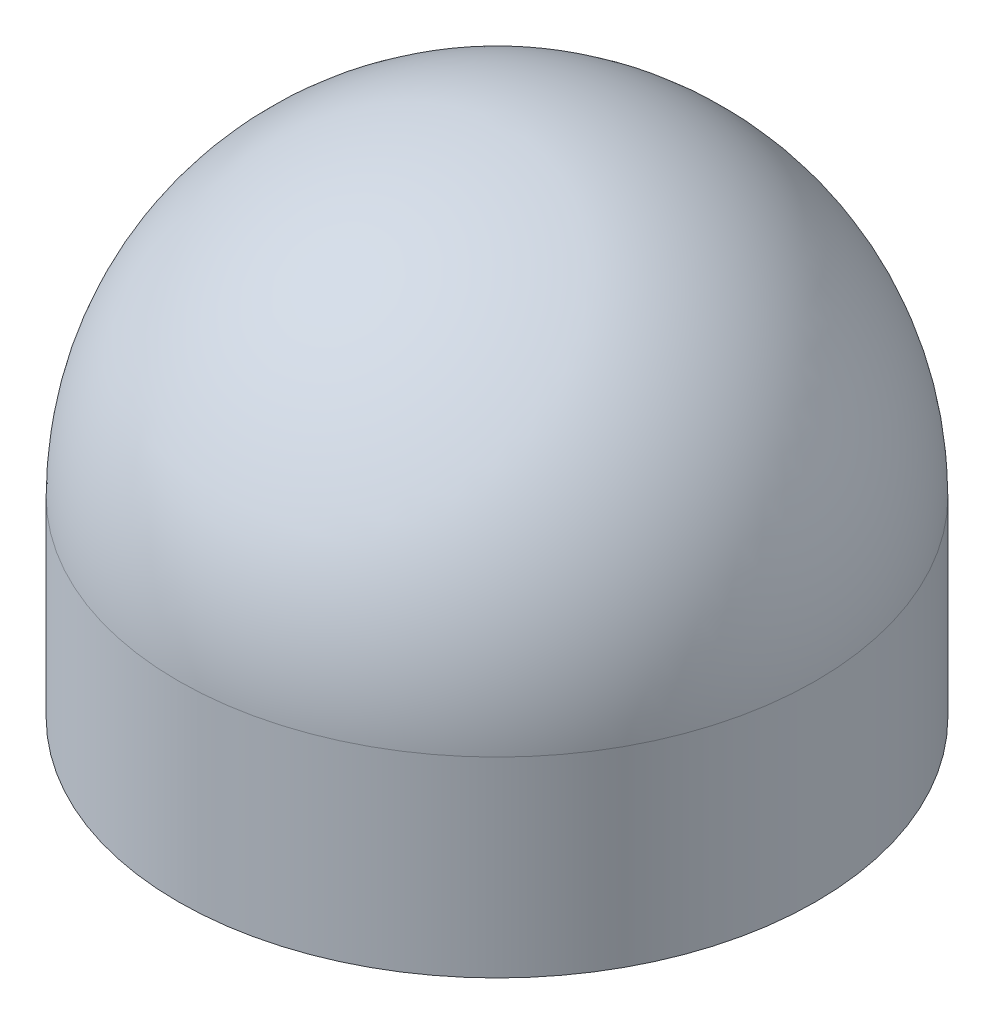
ISO-10303-21;
HEADER;
FILE_DESCRIPTION(('STEP AP214'),'2;1');
FILE_NAME('part.step','',(''),(''),'','','');
FILE_SCHEMA(('AUTOMOTIVE_DESIGN { 1 0 10303 214 1 1 1 1 }'));
ENDSEC;
DATA;
#1=APPLICATION_CONTEXT('core data for automotive mechanical design processes');
#2=APPLICATION_PROTOCOL_DEFINITION('international standard','automotive_design',2000,#1);
#3=PRODUCT_CONTEXT('',#1,'mechanical');
#4=PRODUCT('Part','Part','',(#3));
#5=PRODUCT_RELATED_PRODUCT_CATEGORY('part','',(#4));
#6=PRODUCT_DEFINITION_FORMATION('','',#4);
#7=PRODUCT_DEFINITION_CONTEXT('part definition',#1,'design');
#8=PRODUCT_DEFINITION('design','',#6,#7);
#9=PRODUCT_DEFINITION_SHAPE('','',#8);
#10=(LENGTH_UNIT() NAMED_UNIT(*) SI_UNIT(.MILLI.,.METRE.));
#11=(NAMED_UNIT(*) PLANE_ANGLE_UNIT() SI_UNIT($,.RADIAN.));
#12=(NAMED_UNIT(*) SI_UNIT($,.STERADIAN.) SOLID_ANGLE_UNIT());
#13=UNCERTAINTY_MEASURE_WITH_UNIT(LENGTH_MEASURE(1.E-05),#10,'distance_accuracy_value','');
#14=(GEOMETRIC_REPRESENTATION_CONTEXT(3) GLOBAL_UNCERTAINTY_ASSIGNED_CONTEXT((#13)) GLOBAL_UNIT_ASSIGNED_CONTEXT((#10,
#11,#12)) REPRESENTATION_CONTEXT('',''));
#15=CARTESIAN_POINT('',(0.,0.,0.));
#16=DIRECTION('',(0.,0.,1.));
#17=DIRECTION('',(1.,0.,0.));
#18=AXIS2_PLACEMENT_3D('',#15,#16,#17);
#19=CARTESIAN_POINT('',(0.,0.9,0.));
#20=DIRECTION('',(0.,-1.,0.));
#21=DIRECTION('',(0.,0.,-1.));
#22=AXIS2_PLACEMENT_3D('',#19,#20,#21);
#23=CYLINDRICAL_SURFACE('',#22,1.5);
#24=CARTESIAN_POINT('',(0.,0.9,0.));
#25=DIRECTION('',(0.,1.,0.));
#26=DIRECTION('',(0.,0.,1.));
#27=AXIS2_PLACEMENT_3D('',#24,#25,#26);
#28=CIRCLE('',#27,1.5);
#29=CARTESIAN_POINT('',(0.,0.9,1.5));
#30=VERTEX_POINT('',#29);
#31=EDGE_CURVE('E10',#30,#30,#28,.T.);
#32=ORIENTED_EDGE('',*,*,#31,.F.);
#33=EDGE_LOOP('',(#32));
#34=FACE_BOUND('',#33,.T.);
#35=CARTESIAN_POINT('',(0.,0.,0.));
#36=DIRECTION('',(0.,1.,0.));
#37=DIRECTION('',(0.,0.,1.));
#38=AXIS2_PLACEMENT_3D('',#35,#36,#37);
#39=CIRCLE('',#38,1.5);
#40=CARTESIAN_POINT('',(0.,0.,1.5));
#41=VERTEX_POINT('',#40);
#42=EDGE_CURVE('E39',#41,#41,#39,.T.);
#43=ORIENTED_EDGE('',*,*,#42,.T.);
#44=EDGE_LOOP('',(#43));
#45=FACE_BOUND('',#44,.T.);
#46=ADVANCED_FACE('F32',(#34,#45),#23,.T.);
#47=CARTESIAN_POINT('',(0.,0.9,0.));
#48=DIRECTION('',(0.,0.,1.));
#49=DIRECTION('',(1.,0.,0.));
#50=AXIS2_PLACEMENT_3D('',#47,#48,#49);
#51=SPHERICAL_SURFACE('',#50,1.5);
#52=CARTESIAN_POINT('',(0.,0.9,0.));
#53=DIRECTION('',(0.,1.,0.));
#54=DIRECTION('',(0.,0.,1.));
#55=AXIS2_PLACEMENT_3D('',#52,#53,#54);
#56=SPHERICAL_SURFACE('',#55,1.5);
#57=ORIENTED_EDGE('',*,*,#31,.T.);
#58=EDGE_LOOP('',(#57));
#59=FACE_BOUND('',#58,.T.);
#60=ADVANCED_FACE('F34',(#59),#56,.T.);
#61=CARTESIAN_POINT('',(0.,0.,0.));
#62=DIRECTION('',(0.,1.,0.));
#63=DIRECTION('',(0.,0.,1.));
#64=AXIS2_PLACEMENT_3D('',#61,#62,#63);
#65=PLANE('',#64);
#66=ORIENTED_EDGE('',*,*,#42,.F.);
#67=EDGE_LOOP('',(#66));
#68=FACE_BOUND('',#67,.T.);
#69=ADVANCED_FACE('F46',(#68),#65,.F.);
#70=CLOSED_SHELL('',(#46,#60,#69));
#71=MANIFOLD_SOLID_BREP('B2',#70);
#72=ADVANCED_BREP_SHAPE_REPRESENTATION('',(#18,#71),#14);
#73=SHAPE_DEFINITION_REPRESENTATION(#9,#72);
ENDSEC;
END-ISO-10303-21;
